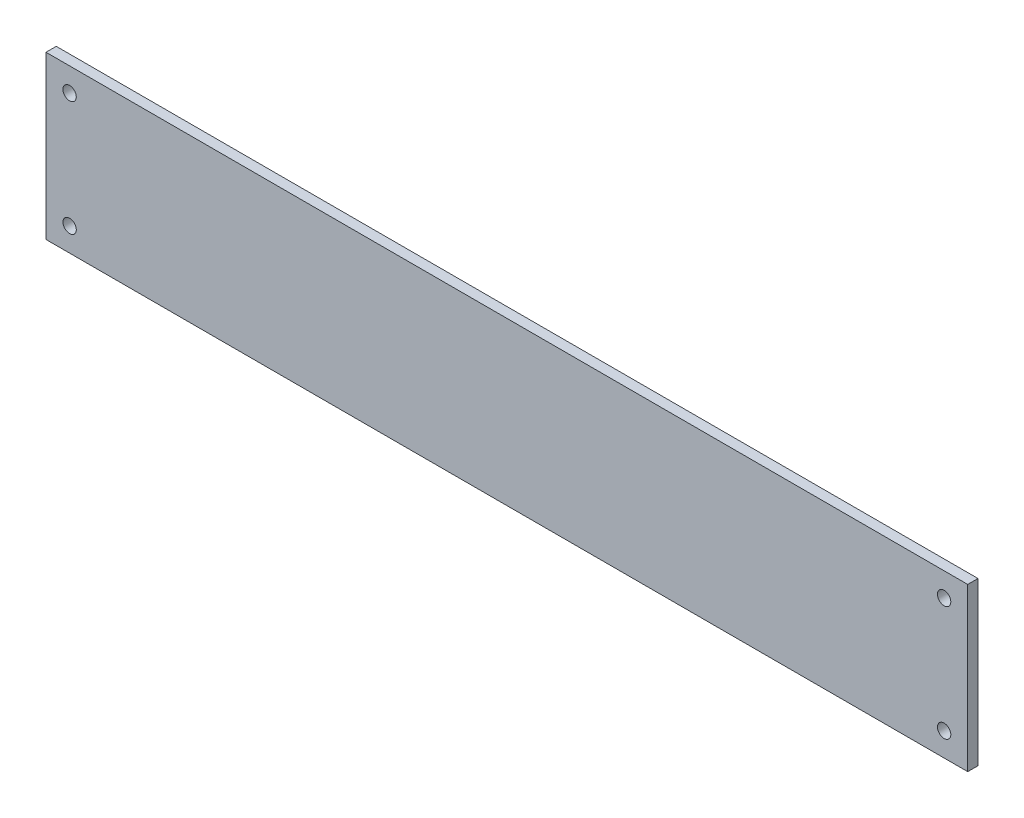
ISO-10303-21;
HEADER;
FILE_DESCRIPTION(('STEP AP214'),'2;1');
FILE_NAME('part.step','',(''),(''),'','','');
FILE_SCHEMA(('AUTOMOTIVE_DESIGN { 1 0 10303 214 1 1 1 1 }'));
ENDSEC;
DATA;
#1=APPLICATION_CONTEXT('core data for automotive mechanical design processes');
#2=APPLICATION_PROTOCOL_DEFINITION('international standard','automotive_design',2000,#1);
#3=PRODUCT_CONTEXT('',#1,'mechanical');
#4=PRODUCT('Part','Part','',(#3));
#5=PRODUCT_RELATED_PRODUCT_CATEGORY('part','',(#4));
#6=PRODUCT_DEFINITION_FORMATION('','',#4);
#7=PRODUCT_DEFINITION_CONTEXT('part definition',#1,'design');
#8=PRODUCT_DEFINITION('design','',#6,#7);
#9=PRODUCT_DEFINITION_SHAPE('','',#8);
#10=(LENGTH_UNIT() NAMED_UNIT(*) SI_UNIT(.MILLI.,.METRE.));
#11=(NAMED_UNIT(*) PLANE_ANGLE_UNIT() SI_UNIT($,.RADIAN.));
#12=(NAMED_UNIT(*) SI_UNIT($,.STERADIAN.) SOLID_ANGLE_UNIT());
#13=UNCERTAINTY_MEASURE_WITH_UNIT(LENGTH_MEASURE(1.E-05),#10,'distance_accuracy_value','');
#14=(GEOMETRIC_REPRESENTATION_CONTEXT(3) GLOBAL_UNCERTAINTY_ASSIGNED_CONTEXT((#13)) GLOBAL_UNIT_ASSIGNED_CONTEXT((#10,
#11,#12)) REPRESENTATION_CONTEXT('',''));
#15=CARTESIAN_POINT('',(0.,0.,0.));
#16=DIRECTION('',(0.,0.,1.));
#17=DIRECTION('',(1.,0.,0.));
#18=AXIS2_PLACEMENT_3D('',#15,#16,#17);
#19=CARTESIAN_POINT('',(0.,0.,5.));
#20=DIRECTION('',(0.,0.,-1.));
#21=DIRECTION('',(-1.,0.,0.));
#22=AXIS2_PLACEMENT_3D('',#19,#20,#21);
#23=PLANE('',#22);
#24=DIRECTION('',(1.,0.,0.));
#25=VECTOR('',#24,1.);
#26=CARTESIAN_POINT('',(449.,0.,5.));
#27=LINE('',#26,#25);
#28=CARTESIAN_POINT('',(0.,0.,5.));
#29=VERTEX_POINT('',#28);
#30=CARTESIAN_POINT('',(449.,0.,5.));
#31=VERTEX_POINT('',#30);
#32=EDGE_CURVE('E97',#29,#31,#27,.T.);
#33=ORIENTED_EDGE('',*,*,#32,.T.);
#34=DIRECTION('',(0.,1.,0.));
#35=VECTOR('',#34,1.);
#36=CARTESIAN_POINT('',(449.,79.,5.));
#37=LINE('',#36,#35);
#38=CARTESIAN_POINT('',(449.,79.,5.));
#39=VERTEX_POINT('',#38);
#40=EDGE_CURVE('E92',#31,#39,#37,.T.);
#41=ORIENTED_EDGE('',*,*,#40,.T.);
#42=DIRECTION('',(-1.,0.,0.));
#43=VECTOR('',#42,1.);
#44=CARTESIAN_POINT('',(0.,79.,5.));
#45=LINE('',#44,#43);
#46=CARTESIAN_POINT('',(0.,79.,5.));
#47=VERTEX_POINT('',#46);
#48=EDGE_CURVE('E95',#39,#47,#45,.T.);
#49=ORIENTED_EDGE('',*,*,#48,.T.);
#50=DIRECTION('',(0.,-1.,0.));
#51=VECTOR('',#50,1.);
#52=CARTESIAN_POINT('',(0.,0.,5.));
#53=LINE('',#52,#51);
#54=EDGE_CURVE('E60',#47,#29,#53,.T.);
#55=ORIENTED_EDGE('',*,*,#54,.T.);
#56=EDGE_LOOP('',(#33,#41,#49,#55));
#57=FACE_BOUND('',#56,.T.);
#58=CARTESIAN_POINT('',(11.5,67.5,5.));
#59=DIRECTION('',(0.,0.,1.));
#60=DIRECTION('',(1.,0.,0.));
#61=AXIS2_PLACEMENT_3D('',#58,#59,#60);
#62=CIRCLE('',#61,3.25);
#63=CARTESIAN_POINT('',(14.75,67.5,5.));
#64=VERTEX_POINT('',#63);
#65=EDGE_CURVE('E112',#64,#64,#62,.T.);
#66=ORIENTED_EDGE('',*,*,#65,.F.);
#67=EDGE_LOOP('',(#66));
#68=FACE_BOUND('',#67,.T.);
#69=CARTESIAN_POINT('',(437.5,67.5,5.));
#70=DIRECTION('',(0.,0.,1.));
#71=DIRECTION('',(-1.,0.,0.));
#72=AXIS2_PLACEMENT_3D('',#69,#70,#71);
#73=CIRCLE('',#72,3.24999999999995);
#74=CARTESIAN_POINT('',(434.25,67.5,5.));
#75=VERTEX_POINT('',#74);
#76=EDGE_CURVE('E129',#75,#75,#73,.T.);
#77=ORIENTED_EDGE('',*,*,#76,.F.);
#78=EDGE_LOOP('',(#77));
#79=FACE_BOUND('',#78,.T.);
#80=CARTESIAN_POINT('',(11.5,11.5,5.));
#81=DIRECTION('',(0.,0.,1.));
#82=DIRECTION('',(-1.,0.,0.));
#83=AXIS2_PLACEMENT_3D('',#80,#81,#82);
#84=CIRCLE('',#83,3.25);
#85=CARTESIAN_POINT('',(8.25,11.5,5.));
#86=VERTEX_POINT('',#85);
#87=EDGE_CURVE('E141',#86,#86,#84,.T.);
#88=ORIENTED_EDGE('',*,*,#87,.F.);
#89=EDGE_LOOP('',(#88));
#90=FACE_BOUND('',#89,.T.);
#91=CARTESIAN_POINT('',(437.5,11.5,5.));
#92=DIRECTION('',(0.,0.,1.));
#93=DIRECTION('',(1.,0.,0.));
#94=AXIS2_PLACEMENT_3D('',#91,#92,#93);
#95=CIRCLE('',#94,3.24999999999995);
#96=CARTESIAN_POINT('',(440.75,11.5,5.));
#97=VERTEX_POINT('',#96);
#98=EDGE_CURVE('E140',#97,#97,#95,.T.);
#99=ORIENTED_EDGE('',*,*,#98,.F.);
#100=EDGE_LOOP('',(#99));
#101=FACE_BOUND('',#100,.T.);
#102=ADVANCED_FACE('F43',(#57,#68,#79,#90,#101),#23,.F.);
#103=CARTESIAN_POINT('',(0.,0.,0.));
#104=DIRECTION('',(0.,0.,-1.));
#105=DIRECTION('',(-1.,0.,0.));
#106=AXIS2_PLACEMENT_3D('',#103,#104,#105);
#107=PLANE('',#106);
#108=CARTESIAN_POINT('',(11.5,11.5,0.));
#109=DIRECTION('',(0.,0.,1.));
#110=DIRECTION('',(-1.,0.,0.));
#111=AXIS2_PLACEMENT_3D('',#108,#109,#110);
#112=CIRCLE('',#111,3.25);
#113=CARTESIAN_POINT('',(8.25,11.5,0.));
#114=VERTEX_POINT('',#113);
#115=EDGE_CURVE('E144',#114,#114,#112,.T.);
#116=ORIENTED_EDGE('',*,*,#115,.T.);
#117=EDGE_LOOP('',(#116));
#118=FACE_BOUND('',#117,.T.);
#119=CARTESIAN_POINT('',(11.5,67.5,0.));
#120=DIRECTION('',(0.,0.,1.));
#121=DIRECTION('',(1.,0.,0.));
#122=AXIS2_PLACEMENT_3D('',#119,#120,#121);
#123=CIRCLE('',#122,3.25);
#124=CARTESIAN_POINT('',(14.75,67.5,0.));
#125=VERTEX_POINT('',#124);
#126=EDGE_CURVE('E124',#125,#125,#123,.T.);
#127=ORIENTED_EDGE('',*,*,#126,.T.);
#128=EDGE_LOOP('',(#127));
#129=FACE_BOUND('',#128,.T.);
#130=DIRECTION('',(1.,0.,0.));
#131=VECTOR('',#130,1.);
#132=CARTESIAN_POINT('',(449.,0.,0.));
#133=LINE('',#132,#131);
#134=CARTESIAN_POINT('',(0.,0.,0.));
#135=VERTEX_POINT('',#134);
#136=CARTESIAN_POINT('',(449.,0.,0.));
#137=VERTEX_POINT('',#136);
#138=EDGE_CURVE('E109',#135,#137,#133,.T.);
#139=ORIENTED_EDGE('',*,*,#138,.F.);
#140=DIRECTION('',(0.,-1.,0.));
#141=VECTOR('',#140,1.);
#142=CARTESIAN_POINT('',(0.,0.,0.));
#143=LINE('',#142,#141);
#144=CARTESIAN_POINT('',(0.,79.,0.));
#145=VERTEX_POINT('',#144);
#146=EDGE_CURVE('E85',#145,#135,#143,.T.);
#147=ORIENTED_EDGE('',*,*,#146,.F.);
#148=DIRECTION('',(-1.,0.,0.));
#149=VECTOR('',#148,1.);
#150=CARTESIAN_POINT('',(0.,79.,0.));
#151=LINE('',#150,#149);
#152=CARTESIAN_POINT('',(449.,79.,0.));
#153=VERTEX_POINT('',#152);
#154=EDGE_CURVE('E79',#153,#145,#151,.T.);
#155=ORIENTED_EDGE('',*,*,#154,.F.);
#156=DIRECTION('',(0.,1.,0.));
#157=VECTOR('',#156,1.);
#158=CARTESIAN_POINT('',(449.,79.,0.));
#159=LINE('',#158,#157);
#160=EDGE_CURVE('E101',#137,#153,#159,.T.);
#161=ORIENTED_EDGE('',*,*,#160,.F.);
#162=EDGE_LOOP('',(#139,#147,#155,#161));
#163=FACE_BOUND('',#162,.T.);
#164=CARTESIAN_POINT('',(437.5,67.5,0.));
#165=DIRECTION('',(0.,0.,1.));
#166=DIRECTION('',(-1.,0.,0.));
#167=AXIS2_PLACEMENT_3D('',#164,#165,#166);
#168=CIRCLE('',#167,3.24999999999995);
#169=CARTESIAN_POINT('',(434.25,67.5,0.));
#170=VERTEX_POINT('',#169);
#171=EDGE_CURVE('E143',#170,#170,#168,.T.);
#172=ORIENTED_EDGE('',*,*,#171,.T.);
#173=EDGE_LOOP('',(#172));
#174=FACE_BOUND('',#173,.T.);
#175=CARTESIAN_POINT('',(437.5,11.5,0.));
#176=DIRECTION('',(0.,0.,1.));
#177=DIRECTION('',(1.,0.,0.));
#178=AXIS2_PLACEMENT_3D('',#175,#176,#177);
#179=CIRCLE('',#178,3.24999999999995);
#180=CARTESIAN_POINT('',(440.75,11.5,0.));
#181=VERTEX_POINT('',#180);
#182=EDGE_CURVE('E134',#181,#181,#179,.T.);
#183=ORIENTED_EDGE('',*,*,#182,.T.);
#184=EDGE_LOOP('',(#183));
#185=FACE_BOUND('',#184,.T.);
#186=ADVANCED_FACE('F120',(#118,#129,#163,#174,#185),#107,.T.);
#187=CARTESIAN_POINT('',(449.,0.,5.));
#188=DIRECTION('',(0.,1.,0.));
#189=DIRECTION('',(-1.,0.,0.));
#190=AXIS2_PLACEMENT_3D('',#187,#188,#189);
#191=PLANE('',#190);
#192=ORIENTED_EDGE('',*,*,#138,.T.);
#193=DIRECTION('',(0.,0.,-1.));
#194=VECTOR('',#193,1.);
#195=CARTESIAN_POINT('',(449.,0.,5.));
#196=LINE('',#195,#194);
#197=EDGE_CURVE('E12',#31,#137,#196,.T.);
#198=ORIENTED_EDGE('',*,*,#197,.F.);
#199=ORIENTED_EDGE('',*,*,#32,.F.);
#200=DIRECTION('',(0.,0.,-1.));
#201=VECTOR('',#200,1.);
#202=CARTESIAN_POINT('',(0.,0.,5.));
#203=LINE('',#202,#201);
#204=EDGE_CURVE('E105',#29,#135,#203,.T.);
#205=ORIENTED_EDGE('',*,*,#204,.T.);
#206=EDGE_LOOP('',(#192,#198,#199,#205));
#207=FACE_BOUND('',#206,.T.);
#208=ADVANCED_FACE('F45',(#207),#191,.F.);
#209=CARTESIAN_POINT('',(449.,79.,5.));
#210=DIRECTION('',(-1.,0.,0.));
#211=DIRECTION('',(0.,0.,1.));
#212=AXIS2_PLACEMENT_3D('',#209,#210,#211);
#213=PLANE('',#212);
#214=ORIENTED_EDGE('',*,*,#160,.T.);
#215=DIRECTION('',(0.,0.,-1.));
#216=VECTOR('',#215,1.);
#217=CARTESIAN_POINT('',(449.,79.,5.));
#218=LINE('',#217,#216);
#219=EDGE_CURVE('E52',#39,#153,#218,.T.);
#220=ORIENTED_EDGE('',*,*,#219,.F.);
#221=ORIENTED_EDGE('',*,*,#40,.F.);
#222=ORIENTED_EDGE('',*,*,#197,.T.);
#223=EDGE_LOOP('',(#214,#220,#221,#222));
#224=FACE_BOUND('',#223,.T.);
#225=ADVANCED_FACE('F100',(#224),#213,.F.);
#226=CARTESIAN_POINT('',(0.,79.,5.));
#227=DIRECTION('',(0.,-1.,0.));
#228=DIRECTION('',(0.,0.,-1.));
#229=AXIS2_PLACEMENT_3D('',#226,#227,#228);
#230=PLANE('',#229);
#231=ORIENTED_EDGE('',*,*,#154,.T.);
#232=DIRECTION('',(0.,0.,-1.));
#233=VECTOR('',#232,1.);
#234=CARTESIAN_POINT('',(0.,79.,5.));
#235=LINE('',#234,#233);
#236=EDGE_CURVE('E102',#47,#145,#235,.T.);
#237=ORIENTED_EDGE('',*,*,#236,.F.);
#238=ORIENTED_EDGE('',*,*,#48,.F.);
#239=ORIENTED_EDGE('',*,*,#219,.T.);
#240=EDGE_LOOP('',(#231,#237,#238,#239));
#241=FACE_BOUND('',#240,.T.);
#242=ADVANCED_FACE('F103',(#241),#230,.F.);
#243=CARTESIAN_POINT('',(0.,0.,5.));
#244=DIRECTION('',(1.,0.,0.));
#245=DIRECTION('',(0.,1.,0.));
#246=AXIS2_PLACEMENT_3D('',#243,#244,#245);
#247=PLANE('',#246);
#248=ORIENTED_EDGE('',*,*,#146,.T.);
#249=ORIENTED_EDGE('',*,*,#204,.F.);
#250=ORIENTED_EDGE('',*,*,#54,.F.);
#251=ORIENTED_EDGE('',*,*,#236,.T.);
#252=EDGE_LOOP('',(#248,#249,#250,#251));
#253=FACE_BOUND('',#252,.T.);
#254=ADVANCED_FACE('F117',(#253),#247,.F.);
#255=CARTESIAN_POINT('',(11.5,67.5,5.));
#256=DIRECTION('',(0.,0.,-1.));
#257=DIRECTION('',(-1.,0.,0.));
#258=AXIS2_PLACEMENT_3D('',#255,#256,#257);
#259=CYLINDRICAL_SURFACE('',#258,3.25);
#260=ORIENTED_EDGE('',*,*,#65,.T.);
#261=EDGE_LOOP('',(#260));
#262=FACE_BOUND('',#261,.T.);
#263=ORIENTED_EDGE('',*,*,#126,.F.);
#264=EDGE_LOOP('',(#263));
#265=FACE_BOUND('',#264,.T.);
#266=ADVANCED_FACE('F159',(#262,#265),#259,.F.);
#267=CARTESIAN_POINT('',(437.5,67.5,5.));
#268=DIRECTION('',(0.,0.,-1.));
#269=DIRECTION('',(-1.,0.,0.));
#270=AXIS2_PLACEMENT_3D('',#267,#268,#269);
#271=CYLINDRICAL_SURFACE('',#270,3.24999999999995);
#272=ORIENTED_EDGE('',*,*,#76,.T.);
#273=EDGE_LOOP('',(#272));
#274=FACE_BOUND('',#273,.T.);
#275=ORIENTED_EDGE('',*,*,#171,.F.);
#276=EDGE_LOOP('',(#275));
#277=FACE_BOUND('',#276,.T.);
#278=ADVANCED_FACE('F156',(#274,#277),#271,.F.);
#279=CARTESIAN_POINT('',(11.5,11.5,5.));
#280=DIRECTION('',(0.,0.,-1.));
#281=DIRECTION('',(-1.,0.,0.));
#282=AXIS2_PLACEMENT_3D('',#279,#280,#281);
#283=CYLINDRICAL_SURFACE('',#282,3.25);
#284=ORIENTED_EDGE('',*,*,#87,.T.);
#285=EDGE_LOOP('',(#284));
#286=FACE_BOUND('',#285,.T.);
#287=ORIENTED_EDGE('',*,*,#115,.F.);
#288=EDGE_LOOP('',(#287));
#289=FACE_BOUND('',#288,.T.);
#290=ADVANCED_FACE('F158',(#286,#289),#283,.F.);
#291=CARTESIAN_POINT('',(437.5,11.5,5.));
#292=DIRECTION('',(0.,0.,-1.));
#293=DIRECTION('',(-1.,0.,0.));
#294=AXIS2_PLACEMENT_3D('',#291,#292,#293);
#295=CYLINDRICAL_SURFACE('',#294,3.24999999999995);
#296=ORIENTED_EDGE('',*,*,#98,.T.);
#297=EDGE_LOOP('',(#296));
#298=FACE_BOUND('',#297,.T.);
#299=ORIENTED_EDGE('',*,*,#182,.F.);
#300=EDGE_LOOP('',(#299));
#301=FACE_BOUND('',#300,.T.);
#302=ADVANCED_FACE('F166',(#298,#301),#295,.F.);
#303=CLOSED_SHELL('',(#102,#186,#208,#225,#242,#254,#266,#278,#290,#302));
#304=MANIFOLD_SOLID_BREP('B2',#303);
#305=ADVANCED_BREP_SHAPE_REPRESENTATION('',(#18,#304),#14);
#306=SHAPE_DEFINITION_REPRESENTATION(#9,#305);
ENDSEC;
END-ISO-10303-21;
